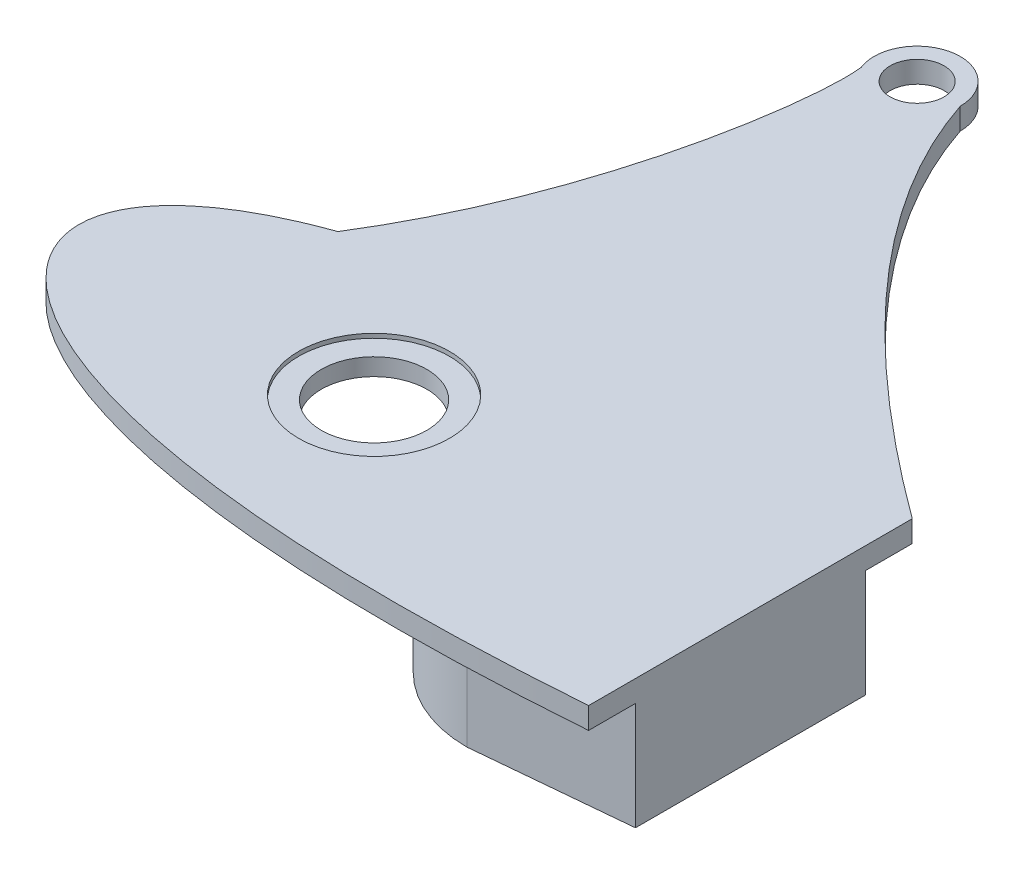
ISO-10303-21;
HEADER;
FILE_DESCRIPTION(('STEP AP214'),'2;1');
FILE_NAME('part.step','',(''),(''),'','','');
FILE_SCHEMA(('AUTOMOTIVE_DESIGN { 1 0 10303 214 1 1 1 1 }'));
ENDSEC;
DATA;
#1=APPLICATION_CONTEXT('core data for automotive mechanical design processes');
#2=APPLICATION_PROTOCOL_DEFINITION('international standard','automotive_design',2000,#1);
#3=PRODUCT_CONTEXT('',#1,'mechanical');
#4=PRODUCT('Part','Part','',(#3));
#5=PRODUCT_RELATED_PRODUCT_CATEGORY('part','',(#4));
#6=PRODUCT_DEFINITION_FORMATION('','',#4);
#7=PRODUCT_DEFINITION_CONTEXT('part definition',#1,'design');
#8=PRODUCT_DEFINITION('design','',#6,#7);
#9=PRODUCT_DEFINITION_SHAPE('','',#8);
#10=(LENGTH_UNIT() NAMED_UNIT(*) SI_UNIT(.MILLI.,.METRE.));
#11=(NAMED_UNIT(*) PLANE_ANGLE_UNIT() SI_UNIT($,.RADIAN.));
#12=(NAMED_UNIT(*) SI_UNIT($,.STERADIAN.) SOLID_ANGLE_UNIT());
#13=UNCERTAINTY_MEASURE_WITH_UNIT(LENGTH_MEASURE(1.E-05),#10,'distance_accuracy_value','');
#14=(GEOMETRIC_REPRESENTATION_CONTEXT(3) GLOBAL_UNCERTAINTY_ASSIGNED_CONTEXT((#13)) GLOBAL_UNIT_ASSIGNED_CONTEXT((#10,
#11,#12)) REPRESENTATION_CONTEXT('',''));
#15=CARTESIAN_POINT('',(0.,0.,0.));
#16=DIRECTION('',(0.,0.,1.));
#17=DIRECTION('',(1.,0.,0.));
#18=AXIS2_PLACEMENT_3D('',#15,#16,#17);
#19=CARTESIAN_POINT('',(-71.828032240755,2.54000000000021,5.55111512312578E-13));
#20=DIRECTION('',(0.,-1.,0.));
#21=DIRECTION('',(0.,0.,-0.999999999999999));
#22=AXIS2_PLACEMENT_3D('',#19,#20,#21);
#23=CYLINDRICAL_SURFACE('',#22,6.22299999999501);
#24=CARTESIAN_POINT('',(-71.828032240755,0.,5.55111512312578E-13));
#25=DIRECTION('',(0.,1.,0.));
#26=DIRECTION('',(0.,0.,0.999999999999999));
#27=AXIS2_PLACEMENT_3D('',#24,#25,#26);
#28=CIRCLE('',#27,6.22299999999501);
#29=CARTESIAN_POINT('',(-71.828032240755,0.,6.22299999999556));
#30=VERTEX_POINT('',#29);
#31=EDGE_CURVE('E291',#30,#30,#28,.T.);
#32=ORIENTED_EDGE('',*,*,#31,.F.);
#33=EDGE_LOOP('',(#32));
#34=FACE_BOUND('',#33,.T.);
#35=CARTESIAN_POINT('',(-71.828032240755,2.03199999999981,5.55111512312578E-13));
#36=DIRECTION('',(0.,1.,0.));
#37=DIRECTION('',(0.,0.,0.999999999999999));
#38=AXIS2_PLACEMENT_3D('',#35,#36,#37);
#39=CIRCLE('',#38,6.22299999999501);
#40=CARTESIAN_POINT('',(-71.828032240755,2.03199999999981,6.22299999999556));
#41=VERTEX_POINT('',#40);
#42=EDGE_CURVE('E139',#41,#41,#39,.T.);
#43=ORIENTED_EDGE('',*,*,#42,.T.);
#44=EDGE_LOOP('',(#43));
#45=FACE_BOUND('',#44,.T.);
#46=ADVANCED_FACE('F134',(#34,#45),#23,.F.);
#47=CARTESIAN_POINT('',(-100.787840288898,0.,-9.37989943616269));
#48=DIRECTION('',(0.,1.,0.));
#49=DIRECTION('',(0.,0.,0.999999999999999));
#50=AXIS2_PLACEMENT_3D('',#47,#48,#49);
#51=PLANE('',#50);
#52=CARTESIAN_POINT('',(-93.0623069318068,0.,-1.49880108324396E-11));
#53=DIRECTION('',(0.,1.,0.));
#54=DIRECTION('',(0.,0.,0.999999999999999));
#55=AXIS2_PLACEMENT_3D('',#52,#53,#54);
#56=CIRCLE('',#55,4.23333333282159);
#57=CARTESIAN_POINT('',(-93.0623069318068,0.,4.2333333328066));
#58=VERTEX_POINT('',#57);
#59=EDGE_CURVE('E333',#58,#58,#56,.T.);
#60=ORIENTED_EDGE('',*,*,#59,.T.);
#61=EDGE_LOOP('',(#60));
#62=FACE_BOUND('',#61,.T.);
#63=ORIENTED_EDGE('',*,*,#31,.T.);
#64=EDGE_LOOP('',(#63));
#65=FACE_BOUND('',#64,.T.);
#66=CARTESIAN_POINT('',(-71.8280322407545,0.,-63.9942784536835));
#67=DIRECTION('',(0.,-1.,0.));
#68=DIRECTION('',(0.,0.,-0.999999999999999));
#69=AXIS2_PLACEMENT_3D('',#66,#67,#68);
#70=CIRCLE('',#69,3.17499999999613);
#71=CARTESIAN_POINT('',(-71.8280322407545,0.,-67.1692784536797));
#72=VERTEX_POINT('',#71);
#73=EDGE_CURVE('E300',#72,#72,#70,.T.);
#74=ORIENTED_EDGE('',*,*,#73,.F.);
#75=EDGE_LOOP('',(#74));
#76=FACE_BOUND('',#75,.T.);
#77=DIRECTION('',(0.995681906627091,0.,0.0928307105188746));
#78=VECTOR('',#77,1.);
#79=CARTESIAN_POINT('',(1.01510215205147,0.,-10.887763764025));
#80=LINE('',#79,#78);
#81=CARTESIAN_POINT('',(-45.6660322407338,0.,-15.2399999999815));
#82=VERTEX_POINT('',#81);
#83=CARTESIAN_POINT('',(-27.4797575526233,0.,-13.5444335848929));
#84=VERTEX_POINT('',#83);
#85=EDGE_CURVE('E329',#82,#84,#80,.T.);
#86=ORIENTED_EDGE('',*,*,#85,.F.);
#87=CARTESIAN_POINT('',(-45.6660322407547,0.,1.7874590696465E-11));
#88=DIRECTION('',(0.,1.,0.));
#89=DIRECTION('',(0.,0.,0.999999999999999));
#90=AXIS2_PLACEMENT_3D('',#87,#88,#89);
#91=CIRCLE('',#90,15.24);
#92=CARTESIAN_POINT('',(-45.6660322407547,0.,15.2400000000178));
#93=VERTEX_POINT('',#92);
#94=EDGE_CURVE('E325',#82,#93,#91,.T.);
#95=ORIENTED_EDGE('',*,*,#94,.T.);
#96=DIRECTION('',(0.995681906627528,0.,-0.0928307105141882));
#97=VECTOR('',#96,1.);
#98=CARTESIAN_POINT('',(1.01510215202327,0.,10.8877637642829));
#99=LINE('',#98,#97);
#100=CARTESIAN_POINT('',(-27.4797575526233,0.,13.5444335850131));
#101=VERTEX_POINT('',#100);
#102=EDGE_CURVE('E321',#93,#101,#99,.T.);
#103=ORIENTED_EDGE('',*,*,#102,.T.);
#104=DIRECTION('',(0.,0.,0.999999999999999));
#105=VECTOR('',#104,1.);
#106=CARTESIAN_POINT('',(-27.4797575526231,0.,-19.0692045360898));
#107=LINE('',#106,#105);
#108=CARTESIAN_POINT('',(-27.4797575526233,0.,19.0692045361251));
#109=VERTEX_POINT('',#108);
#110=EDGE_CURVE('E427',#101,#109,#107,.T.);
#111=ORIENTED_EDGE('',*,*,#110,.T.);
#112=CARTESIAN_POINT('',(-106.608177042693,0.,-2.40918396343659E-11));
#113=CARTESIAN_POINT('',(-106.607181852749,0.,0.336221439301454));
#114=CARTESIAN_POINT('',(-106.553109217043,0.,1.1724708441877));
#115=CARTESIAN_POINT('',(-106.231145111325,0.,2.64309926122397));
#116=CARTESIAN_POINT('',(-105.43920338288,0.,4.47521740094181));
#117=CARTESIAN_POINT('',(-104.022724766245,0.,6.50434841127334));
#118=CARTESIAN_POINT('',(-101.933239025809,0.,8.57165132499871));
#119=CARTESIAN_POINT('',(-99.1919114881492,0.,10.567556696316));
#120=CARTESIAN_POINT('',(-95.8449968360548,0.,12.426747292297));
#121=CARTESIAN_POINT('',(-91.9425260766369,0.,14.1114417039812));
#122=CARTESIAN_POINT('',(-87.5318954831836,0.,15.5993181547301));
#123=CARTESIAN_POINT('',(-82.6571006592551,0.,16.8771333157254));
#124=CARTESIAN_POINT('',(-77.3593433017097,0.,17.9374356125432));
#125=CARTESIAN_POINT('',(-71.6778007456686,0.,18.7767405652854));
#126=CARTESIAN_POINT('',(-65.6503412533955,0.,19.3954605787643));
#127=CARTESIAN_POINT('',(-59.3137850653509,0.,19.7965740230732));
#128=CARTESIAN_POINT('',(-52.7042467276422,0.,19.9862763091176));
#129=CARTESIAN_POINT('',(-45.8571956117444,0.,19.9728658304196));
#130=CARTESIAN_POINT('',(-38.8075573417097,0.,19.7673224628712));
#131=CARTESIAN_POINT('',(-32.659211886195,0.,19.4395653250897));
#132=CARTESIAN_POINT('',(-28.8658001620383,0.,19.174037810697));
#133=CARTESIAN_POINT('',(-27.4797575526233,0.,19.0692045361251));
#134=B_SPLINE_CURVE_WITH_KNOTS('',3,(#112,#113,#114,#115,#116,#117,#118,#119,#120,#121,#122,
#123,#124,#125,#126,#127,#128,#129,#130,#131,#132,#133),.UNSPECIFIED.,.F.,.F.,(4,1,1,1,1,1,1,1,
1,1,1,1,1,1,1,1,1,1,1,4),(0.5,0.502166768562745,0.505390167385713,0.509655974305835,
0.514947681887198,0.521244711429097,0.528520886222697,0.536744945012688,0.545881360311019,
0.555890751085959,0.566730118512969,0.578352990409744,0.59070958813284,0.603747039427916,
0.617409572172202,0.631638768029288,0.646373793426418,0.66155165817642,0.677107482822761,
0.6860697244594),.UNSPECIFIED.);
#135=CARTESIAN_POINT('',(-106.608177042693,0.,-2.40918396343659E-11));
#136=VERTEX_POINT('',#135);
#137=EDGE_CURVE('E290',#136,#109,#134,.T.);
#138=ORIENTED_EDGE('',*,*,#137,.F.);
#139=CARTESIAN_POINT('',(-106.608177042693,0.,-2.40918396343659E-11));
#140=CARTESIAN_POINT('',(-106.607181852748,0.,-0.336221439350415));
#141=CARTESIAN_POINT('',(-106.553109217039,0.,-1.17247084423733));
#142=CARTESIAN_POINT('',(-106.231145111316,0.,-2.64309926127493));
#143=CARTESIAN_POINT('',(-105.439203382865,0.,-4.4752174009941));
#144=CARTESIAN_POINT('',(-104.022724766221,0.,-6.50434841132486));
#145=CARTESIAN_POINT('',(-101.933239025776,0.,-8.57165132504756));
#146=CARTESIAN_POINT('',(-99.1919114881057,0.,-10.5675566963589));
#147=CARTESIAN_POINT('',(-95.8449968360004,0.,-12.4267472923335));
#148=CARTESIAN_POINT('',(-92.9040958197425,0.,-13.6963325917004));
#149=CARTESIAN_POINT('',(-91.0995653454139,0.,-14.3638445961974));
#150=CARTESIAN_POINT('',(-90.6222284065501,0.,-14.5334115477175));
#151=B_SPLINE_CURVE_WITH_KNOTS('',3,(#139,#140,#141,#142,#143,#144,#145,#146,#147,#148,#149,
#150),.UNSPECIFIED.,.F.,.F.,(4,1,1,1,1,1,1,1,1,4),(0.5,0.502166768562745,0.505390167385713,
0.509655974305835,0.514947681887198,0.521244711429097,0.528520886222697,0.536744945012688,
0.545881360311019,0.549146809734544),.UNSPECIFIED.);
#152=CARTESIAN_POINT('',(-90.6222284065501,0.,-14.5334115477175));
#153=VERTEX_POINT('',#152);
#154=EDGE_CURVE('E298',#136,#153,#151,.T.);
#155=ORIENTED_EDGE('',*,*,#154,.T.);
#156=CARTESIAN_POINT('',(-90.6222284065501,0.,-14.5334115477175));
#157=CARTESIAN_POINT('',(-78.6766231938323,0.,-33.6240352561603));
#158=CARTESIAN_POINT('',(-75.8140328910315,0.,-56.6964019830253));
#159=CARTESIAN_POINT('',(-76.5562174906114,0.,-62.136682091974));
#160=B_SPLINE_CURVE_WITH_KNOTS('',3,(#156,#157,#158,#159),.UNSPECIFIED.,.F.,.F.,(4,4),(0.,1.),.UNSPECIFIED.);
#161=CARTESIAN_POINT('',(-76.5562174906114,0.,-62.136682091974));
#162=VERTEX_POINT('',#161);
#163=EDGE_CURVE('E407',#153,#162,#160,.T.);
#164=ORIENTED_EDGE('',*,*,#163,.T.);
#165=CARTESIAN_POINT('',(-71.8280322407545,0.,-63.9942784536835));
#166=DIRECTION('',(0.,-1.,0.));
#167=DIRECTION('',(0.,0.,-0.999999999999999));
#168=AXIS2_PLACEMENT_3D('',#165,#166,#167);
#169=CIRCLE('',#168,5.08);
#170=CARTESIAN_POINT('',(-66.748032240755,0.,-63.9942784536837));
#171=VERTEX_POINT('',#170);
#172=EDGE_CURVE('E416',#162,#171,#169,.T.);
#173=ORIENTED_EDGE('',*,*,#172,.T.);
#174=CARTESIAN_POINT('',(-66.748032240755,0.,-63.9942784536837));
#175=CARTESIAN_POINT('',(-59.6627837087809,0.,-42.6772678713619));
#176=CARTESIAN_POINT('',(-27.4797575526231,0.,-19.0692045360898));
#177=B_SPLINE_CURVE_WITH_KNOTS('',2,(#174,#175,#176),.UNSPECIFIED.,.F.,.F.,(3,3),(0.,1.),.UNSPECIFIED.);
#178=CARTESIAN_POINT('',(-27.4797575526231,0.,-19.0692045360898));
#179=VERTEX_POINT('',#178);
#180=EDGE_CURVE('E423',#171,#179,#177,.T.);
#181=ORIENTED_EDGE('',*,*,#180,.T.);
#182=EDGE_CURVE('E230',#179,#84,#107,.T.);
#183=ORIENTED_EDGE('',*,*,#182,.T.);
#184=EDGE_LOOP('',(#86,#95,#103,#111,#138,#155,#164,#173,#181,#183));
#185=FACE_BOUND('',#184,.T.);
#186=ADVANCED_FACE('F378',(#62,#65,#76,#185),#51,.F.);
#187=CARTESIAN_POINT('',(-100.787840288898,2.54000000000021,-9.37989943616269));
#188=DIRECTION('',(0.,1.,0.));
#189=DIRECTION('',(0.,0.,0.999999999999999));
#190=AXIS2_PLACEMENT_3D('',#187,#188,#189);
#191=PLANE('',#190);
#192=CARTESIAN_POINT('',(-71.828032240755,2.54000000000021,5.55111512312578E-13));
#193=DIRECTION('',(0.,1.,0.));
#194=DIRECTION('',(0.,0.,0.999999999999999));
#195=AXIS2_PLACEMENT_3D('',#192,#193,#194);
#196=CIRCLE('',#195,8.88999999999499);
#197=CARTESIAN_POINT('',(-71.828032240755,2.54000000000021,8.88999999999554));
#198=VERTEX_POINT('',#197);
#199=EDGE_CURVE('E353',#198,#198,#196,.T.);
#200=ORIENTED_EDGE('',*,*,#199,.F.);
#201=EDGE_LOOP('',(#200));
#202=FACE_BOUND('',#201,.T.);
#203=CARTESIAN_POINT('',(-71.8280322407545,2.54000000000021,-63.9942784536835));
#204=DIRECTION('',(0.,-1.,0.));
#205=DIRECTION('',(0.,0.,-0.999999999999999));
#206=AXIS2_PLACEMENT_3D('',#203,#204,#205);
#207=CIRCLE('',#206,3.17499999999613);
#208=CARTESIAN_POINT('',(-71.8280322407545,2.54000000000021,-67.1692784536797));
#209=VERTEX_POINT('',#208);
#210=EDGE_CURVE('E299',#209,#209,#207,.T.);
#211=ORIENTED_EDGE('',*,*,#210,.T.);
#212=EDGE_LOOP('',(#211));
#213=FACE_BOUND('',#212,.T.);
#214=CARTESIAN_POINT('',(-106.608177042693,2.54000000000021,-2.40918396343659E-11));
#215=CARTESIAN_POINT('',(-106.607181852748,2.54000000000021,-0.336221439350415));
#216=CARTESIAN_POINT('',(-106.553109217039,2.54000000000021,-1.17247084423733));
#217=CARTESIAN_POINT('',(-106.231145111316,2.54000000000021,-2.64309926127493));
#218=CARTESIAN_POINT('',(-105.439203382865,2.54000000000021,-4.4752174009941));
#219=CARTESIAN_POINT('',(-104.022724766221,2.54000000000021,-6.50434841132486));
#220=CARTESIAN_POINT('',(-101.933239025776,2.54000000000021,-8.57165132504756));
#221=CARTESIAN_POINT('',(-99.1919114881057,2.54000000000021,-10.5675566963589));
#222=CARTESIAN_POINT('',(-95.8449968360004,2.54000000000021,-12.4267472923335));
#223=CARTESIAN_POINT('',(-92.9040958197425,2.54000000000021,-13.6963325917004));
#224=CARTESIAN_POINT('',(-91.0995653454139,2.54000000000021,-14.3638445961974));
#225=CARTESIAN_POINT('',(-90.6222284065501,2.54000000000021,-14.5334115477175));
#226=B_SPLINE_CURVE_WITH_KNOTS('',3,(#214,#215,#216,#217,#218,#219,#220,#221,#222,#223,#224,
#225),.UNSPECIFIED.,.F.,.F.,(4,1,1,1,1,1,1,1,1,4),(0.5,0.502166768562745,0.505390167385713,
0.509655974305835,0.514947681887198,0.521244711429097,0.528520886222697,0.536744945012688,
0.545881360311019,0.549146809734544),.UNSPECIFIED.);
#227=CARTESIAN_POINT('',(-106.608177042693,2.54000000000021,-2.40918396343659E-11));
#228=VERTEX_POINT('',#227);
#229=CARTESIAN_POINT('',(-90.6222284065501,2.54000000000021,-14.5334115477175));
#230=VERTEX_POINT('',#229);
#231=EDGE_CURVE('E281',#228,#230,#226,.T.);
#232=ORIENTED_EDGE('',*,*,#231,.F.);
#233=CARTESIAN_POINT('',(-106.608177042693,2.54000000000021,-2.40918396343659E-11));
#234=CARTESIAN_POINT('',(-106.607181852749,2.54000000000021,0.336221439301454));
#235=CARTESIAN_POINT('',(-106.553109217043,2.54000000000021,1.1724708441877));
#236=CARTESIAN_POINT('',(-106.231145111325,2.54000000000021,2.64309926122397));
#237=CARTESIAN_POINT('',(-105.43920338288,2.54000000000021,4.47521740094181));
#238=CARTESIAN_POINT('',(-104.022724766245,2.54000000000021,6.50434841127334));
#239=CARTESIAN_POINT('',(-101.933239025809,2.54000000000021,8.57165132499871));
#240=CARTESIAN_POINT('',(-99.1919114881492,2.54000000000021,10.567556696316));
#241=CARTESIAN_POINT('',(-95.8449968360548,2.54000000000021,12.426747292297));
#242=CARTESIAN_POINT('',(-91.9425260766369,2.54000000000021,14.1114417039812));
#243=CARTESIAN_POINT('',(-87.5318954831836,2.54000000000021,15.5993181547301));
#244=CARTESIAN_POINT('',(-82.6571006592551,2.54000000000021,16.8771333157254));
#245=CARTESIAN_POINT('',(-77.3593433017097,2.54000000000021,17.9374356125432));
#246=CARTESIAN_POINT('',(-71.6778007456686,2.54000000000021,18.7767405652854));
#247=CARTESIAN_POINT('',(-65.6503412533955,2.54000000000021,19.3954605787643));
#248=CARTESIAN_POINT('',(-59.3137850653509,2.54000000000021,19.7965740230732));
#249=CARTESIAN_POINT('',(-52.7042467276422,2.54000000000021,19.9862763091176));
#250=CARTESIAN_POINT('',(-45.8571956117444,2.54000000000021,19.9728658304196));
#251=CARTESIAN_POINT('',(-38.8075573417097,2.54000000000021,19.7673224628712));
#252=CARTESIAN_POINT('',(-32.659211886195,2.54000000000021,19.4395653250897));
#253=CARTESIAN_POINT('',(-28.8658001620383,2.54000000000021,19.174037810697));
#254=CARTESIAN_POINT('',(-27.4797575526233,2.54000000000021,19.0692045361251));
#255=B_SPLINE_CURVE_WITH_KNOTS('',3,(#233,#234,#235,#236,#237,#238,#239,#240,#241,#242,#243,
#244,#245,#246,#247,#248,#249,#250,#251,#252,#253,#254),.UNSPECIFIED.,.F.,.F.,(4,1,1,1,1,1,1,1,
1,1,1,1,1,1,1,1,1,1,1,4),(0.5,0.502166768562745,0.505390167385713,0.509655974305835,
0.514947681887198,0.521244711429097,0.528520886222697,0.536744945012688,0.545881360311019,
0.555890751085959,0.566730118512969,0.578352990409744,0.59070958813284,0.603747039427916,
0.617409572172202,0.631638768029288,0.646373793426418,0.66155165817642,0.677107482822761,
0.6860697244594),.UNSPECIFIED.);
#256=CARTESIAN_POINT('',(-27.4797575526233,2.54000000000021,19.0692045361251));
#257=VERTEX_POINT('',#256);
#258=EDGE_CURVE('E245',#228,#257,#255,.T.);
#259=ORIENTED_EDGE('',*,*,#258,.T.);
#260=DIRECTION('',(0.,0.,0.999999999999999));
#261=VECTOR('',#260,1.);
#262=CARTESIAN_POINT('',(-27.4797575526231,2.54000000000021,-19.0692045360898));
#263=LINE('',#262,#261);
#264=CARTESIAN_POINT('',(-27.4797575526231,2.54000000000021,-19.0692045360898));
#265=VERTEX_POINT('',#264);
#266=EDGE_CURVE('E227',#265,#257,#263,.T.);
#267=ORIENTED_EDGE('',*,*,#266,.F.);
#268=CARTESIAN_POINT('',(-66.748032240755,2.54000000000021,-63.9942784536837));
#269=CARTESIAN_POINT('',(-59.6627837087809,2.54000000000021,-42.6772678713619));
#270=CARTESIAN_POINT('',(-27.4797575526231,2.54000000000021,-19.0692045360898));
#271=B_SPLINE_CURVE_WITH_KNOTS('',2,(#268,#269,#270),.UNSPECIFIED.,.F.,.F.,(3,3),(0.,1.),.UNSPECIFIED.);
#272=CARTESIAN_POINT('',(-66.748032240755,2.54000000000021,-63.9942784536837));
#273=VERTEX_POINT('',#272);
#274=EDGE_CURVE('E243',#273,#265,#271,.T.);
#275=ORIENTED_EDGE('',*,*,#274,.F.);
#276=CARTESIAN_POINT('',(-71.8280322407545,2.54000000000021,-63.9942784536835));
#277=DIRECTION('',(0.,-1.,0.));
#278=DIRECTION('',(0.,0.,-0.999999999999999));
#279=AXIS2_PLACEMENT_3D('',#276,#277,#278);
#280=CIRCLE('',#279,5.08);
#281=CARTESIAN_POINT('',(-76.5562174906114,2.54000000000021,-62.136682091974));
#282=VERTEX_POINT('',#281);
#283=EDGE_CURVE('E251',#282,#273,#280,.T.);
#284=ORIENTED_EDGE('',*,*,#283,.F.);
#285=CARTESIAN_POINT('',(-90.6222284065501,2.54000000000021,-14.5334115477175));
#286=CARTESIAN_POINT('',(-78.6766231938323,2.54000000000021,-33.6240352561603));
#287=CARTESIAN_POINT('',(-75.8140328910315,2.54000000000021,-56.6964019830253));
#288=CARTESIAN_POINT('',(-76.5562174906114,2.54000000000021,-62.136682091974));
#289=B_SPLINE_CURVE_WITH_KNOTS('',3,(#285,#286,#287,#288),.UNSPECIFIED.,.F.,.F.,(4,4),(0.,1.),.UNSPECIFIED.);
#290=EDGE_CURVE('E256',#230,#282,#289,.T.);
#291=ORIENTED_EDGE('',*,*,#290,.F.);
#292=EDGE_LOOP('',(#232,#259,#267,#275,#284,#291));
#293=FACE_BOUND('',#292,.T.);
#294=ADVANCED_FACE('F241',(#202,#213,#293),#191,.T.);
#295=DIRECTION('',(0.,-1.,0.));
#296=VECTOR('',#295,1.);
#297=SURFACE_OF_LINEAR_EXTRUSION('',#226,#296);
#298=ORIENTED_EDGE('',*,*,#154,.F.);
#299=DIRECTION('',(0.,-1.,0.));
#300=VECTOR('',#299,1.);
#301=CARTESIAN_POINT('',(-106.608177042693,2.54000000000021,-2.40918396343659E-11));
#302=LINE('',#301,#300);
#303=EDGE_CURVE('E12',#228,#136,#302,.T.);
#304=ORIENTED_EDGE('',*,*,#303,.F.);
#305=ORIENTED_EDGE('',*,*,#231,.T.);
#306=DIRECTION('',(0.,-1.,0.));
#307=VECTOR('',#306,1.);
#308=CARTESIAN_POINT('',(-90.6222284065501,2.54000000000021,-14.5334115477175));
#309=LINE('',#308,#307);
#310=EDGE_CURVE('E205',#230,#153,#309,.T.);
#311=ORIENTED_EDGE('',*,*,#310,.T.);
#312=EDGE_LOOP('',(#298,#304,#305,#311));
#313=FACE_BOUND('',#312,.T.);
#314=ADVANCED_FACE('F136',(#313),#297,.T.);
#315=DIRECTION('',(0.,-1.,0.));
#316=VECTOR('',#315,1.);
#317=SURFACE_OF_LINEAR_EXTRUSION('',#255,#316);
#318=ORIENTED_EDGE('',*,*,#137,.T.);
#319=DIRECTION('',(0.,-1.,0.));
#320=VECTOR('',#319,1.);
#321=CARTESIAN_POINT('',(-27.4797575526233,2.54000000000021,19.0692045361251));
#322=LINE('',#321,#320);
#323=EDGE_CURVE('E145',#257,#109,#322,.T.);
#324=ORIENTED_EDGE('',*,*,#323,.F.);
#325=ORIENTED_EDGE('',*,*,#258,.F.);
#326=ORIENTED_EDGE('',*,*,#303,.T.);
#327=EDGE_LOOP('',(#318,#324,#325,#326));
#328=FACE_BOUND('',#327,.T.);
#329=ADVANCED_FACE('F392',(#328),#317,.F.);
#330=CARTESIAN_POINT('',(-27.4797575526231,2.54000000000021,-19.0692045360898));
#331=DIRECTION('',(0.999999999999999,0.,0.));
#332=DIRECTION('',(0.,0.,-0.999999999999999));
#333=AXIS2_PLACEMENT_3D('',#330,#331,#332);
#334=PLANE('',#333);
#335=ORIENTED_EDGE('',*,*,#182,.F.);
#336=DIRECTION('',(0.,-1.,0.));
#337=VECTOR('',#336,1.);
#338=CARTESIAN_POINT('',(-27.4797575526231,2.54000000000021,-19.0692045360898));
#339=LINE('',#338,#337);
#340=EDGE_CURVE('E223',#265,#179,#339,.T.);
#341=ORIENTED_EDGE('',*,*,#340,.F.);
#342=ORIENTED_EDGE('',*,*,#266,.T.);
#343=ORIENTED_EDGE('',*,*,#323,.T.);
#344=ORIENTED_EDGE('',*,*,#110,.F.);
#345=DIRECTION('',(0.,1.,0.));
#346=VECTOR('',#345,1.);
#347=CARTESIAN_POINT('',(-27.4797575526233,-12.7000000000002,13.5444335850131));
#348=LINE('',#347,#346);
#349=CARTESIAN_POINT('',(-27.4797575526233,-12.7000000000002,13.5444335850131));
#350=VERTEX_POINT('',#349);
#351=EDGE_CURVE('E156',#350,#101,#348,.T.);
#352=ORIENTED_EDGE('',*,*,#351,.F.);
#353=DIRECTION('',(0.,0.,0.999999999999999));
#354=VECTOR('',#353,1.);
#355=CARTESIAN_POINT('',(-27.4797575526229,-12.7000000000002,8.88178419700125E-13));
#356=LINE('',#355,#354);
#357=CARTESIAN_POINT('',(-27.4797575526233,-12.7000000000002,-13.5444335848929));
#358=VERTEX_POINT('',#357);
#359=EDGE_CURVE('E313',#358,#350,#356,.T.);
#360=ORIENTED_EDGE('',*,*,#359,.F.);
#361=DIRECTION('',(0.,1.,0.));
#362=VECTOR('',#361,1.);
#363=CARTESIAN_POINT('',(-27.4797575526233,-12.7000000000002,-13.5444335848929));
#364=LINE('',#363,#362);
#365=EDGE_CURVE('E304',#358,#84,#364,.T.);
#366=ORIENTED_EDGE('',*,*,#365,.T.);
#367=EDGE_LOOP('',(#335,#341,#342,#343,#344,#352,#360,#366));
#368=FACE_BOUND('',#367,.T.);
#369=ADVANCED_FACE('F225',(#368),#334,.T.);
#370=DIRECTION('',(0.,-1.,0.));
#371=VECTOR('',#370,1.);
#372=SURFACE_OF_LINEAR_EXTRUSION('',#271,#371);
#373=ORIENTED_EDGE('',*,*,#180,.F.);
#374=DIRECTION('',(0.,-1.,0.));
#375=VECTOR('',#374,1.);
#376=CARTESIAN_POINT('',(-66.748032240755,2.54000000000021,-63.9942784536837));
#377=LINE('',#376,#375);
#378=EDGE_CURVE('E236',#273,#171,#377,.T.);
#379=ORIENTED_EDGE('',*,*,#378,.F.);
#380=ORIENTED_EDGE('',*,*,#274,.T.);
#381=ORIENTED_EDGE('',*,*,#340,.T.);
#382=EDGE_LOOP('',(#373,#379,#380,#381));
#383=FACE_BOUND('',#382,.T.);
#384=ADVANCED_FACE('F249',(#383),#372,.T.);
#385=CARTESIAN_POINT('',(-71.8280322407545,2.54000000000021,-63.9942784536835));
#386=DIRECTION('',(0.,-1.,0.));
#387=DIRECTION('',(0.,0.,-0.999999999999999));
#388=AXIS2_PLACEMENT_3D('',#385,#386,#387);
#389=CYLINDRICAL_SURFACE('',#388,5.08);
#390=ORIENTED_EDGE('',*,*,#172,.F.);
#391=DIRECTION('',(0.,-1.,0.));
#392=VECTOR('',#391,1.);
#393=CARTESIAN_POINT('',(-76.5562174906114,2.54000000000021,-62.136682091974));
#394=LINE('',#393,#392);
#395=EDGE_CURVE('E444',#282,#162,#394,.T.);
#396=ORIENTED_EDGE('',*,*,#395,.F.);
#397=ORIENTED_EDGE('',*,*,#283,.T.);
#398=ORIENTED_EDGE('',*,*,#378,.T.);
#399=EDGE_LOOP('',(#390,#396,#397,#398));
#400=FACE_BOUND('',#399,.T.);
#401=ADVANCED_FACE('F270',(#400),#389,.T.);
#402=DIRECTION('',(0.,-1.,0.));
#403=VECTOR('',#402,1.);
#404=SURFACE_OF_LINEAR_EXTRUSION('',#289,#403);
#405=ORIENTED_EDGE('',*,*,#163,.F.);
#406=ORIENTED_EDGE('',*,*,#310,.F.);
#407=ORIENTED_EDGE('',*,*,#290,.T.);
#408=ORIENTED_EDGE('',*,*,#395,.T.);
#409=EDGE_LOOP('',(#405,#406,#407,#408));
#410=FACE_BOUND('',#409,.T.);
#411=ADVANCED_FACE('F273',(#410),#404,.T.);
#412=CARTESIAN_POINT('',(-71.8280322407545,2.54000000000021,-63.9942784536835));
#413=DIRECTION('',(0.,-1.,0.));
#414=DIRECTION('',(0.,0.,-0.999999999999999));
#415=AXIS2_PLACEMENT_3D('',#412,#413,#414);
#416=CYLINDRICAL_SURFACE('',#415,3.17499999999613);
#417=ORIENTED_EDGE('',*,*,#210,.F.);
#418=EDGE_LOOP('',(#417));
#419=FACE_BOUND('',#418,.T.);
#420=ORIENTED_EDGE('',*,*,#73,.T.);
#421=EDGE_LOOP('',(#420));
#422=FACE_BOUND('',#421,.T.);
#423=ADVANCED_FACE('F276',(#419,#422),#416,.F.);
#424=CARTESIAN_POINT('',(1.01510215205147,-12.7000000000002,-10.887763764025));
#425=DIRECTION('',(-0.0928307105188746,0.,0.995681906627091));
#426=DIRECTION('',(0.995681906627092,0.,0.0928307105188746));
#427=AXIS2_PLACEMENT_3D('',#424,#425,#426);
#428=PLANE('',#427);
#429=ORIENTED_EDGE('',*,*,#85,.T.);
#430=ORIENTED_EDGE('',*,*,#365,.F.);
#431=DIRECTION('',(0.995681906627091,0.,0.0928307105188746));
#432=VECTOR('',#431,1.);
#433=CARTESIAN_POINT('',(1.01510215205147,-12.7000000000002,-10.887763764025));
#434=LINE('',#433,#432);
#435=CARTESIAN_POINT('',(-45.6660322407338,-12.7000000000002,-15.2399999999815));
#436=VERTEX_POINT('',#435);
#437=EDGE_CURVE('E324',#436,#358,#434,.T.);
#438=ORIENTED_EDGE('',*,*,#437,.F.);
#439=DIRECTION('',(0.,1.,0.));
#440=VECTOR('',#439,1.);
#441=CARTESIAN_POINT('',(-45.6660322407338,-12.7000000000002,-15.2399999999815));
#442=LINE('',#441,#440);
#443=EDGE_CURVE('E308',#436,#82,#442,.T.);
#444=ORIENTED_EDGE('',*,*,#443,.T.);
#445=EDGE_LOOP('',(#429,#430,#438,#444));
#446=FACE_BOUND('',#445,.T.);
#447=ADVANCED_FACE('F475',(#446),#428,.F.);
#448=CARTESIAN_POINT('',(1.01510215202327,-12.7000000000002,10.8877637642829));
#449=DIRECTION('',(0.0928307105141883,0.,0.995681906627528));
#450=DIRECTION('',(0.995681906627528,0.,-0.0928307105141882));
#451=AXIS2_PLACEMENT_3D('',#448,#449,#450);
#452=PLANE('',#451);
#453=ORIENTED_EDGE('',*,*,#102,.F.);
#454=DIRECTION('',(0.,1.,0.));
#455=VECTOR('',#454,1.);
#456=CARTESIAN_POINT('',(-45.6660322407547,-12.7000000000002,15.2400000000178));
#457=LINE('',#456,#455);
#458=CARTESIAN_POINT('',(-45.6660322407547,-12.7000000000002,15.2400000000178));
#459=VERTEX_POINT('',#458);
#460=EDGE_CURVE('E312',#459,#93,#457,.T.);
#461=ORIENTED_EDGE('',*,*,#460,.F.);
#462=DIRECTION('',(0.995681906627528,0.,-0.0928307105141882));
#463=VECTOR('',#462,1.);
#464=CARTESIAN_POINT('',(1.01510215202327,-12.7000000000002,10.8877637642829));
#465=LINE('',#464,#463);
#466=EDGE_CURVE('E337',#459,#350,#465,.T.);
#467=ORIENTED_EDGE('',*,*,#466,.T.);
#468=ORIENTED_EDGE('',*,*,#351,.T.);
#469=EDGE_LOOP('',(#453,#461,#467,#468));
#470=FACE_BOUND('',#469,.T.);
#471=ADVANCED_FACE('F458',(#470),#452,.T.);
#472=CARTESIAN_POINT('',(-45.6660322407547,-12.7000000000002,1.7874590696465E-11));
#473=DIRECTION('',(0.,1.,0.));
#474=DIRECTION('',(0.,0.,0.999999999999999));
#475=AXIS2_PLACEMENT_3D('',#472,#473,#474);
#476=CYLINDRICAL_SURFACE('',#475,15.24);
#477=ORIENTED_EDGE('',*,*,#94,.F.);
#478=ORIENTED_EDGE('',*,*,#443,.F.);
#479=CARTESIAN_POINT('',(-45.6660322407547,-12.7000000000002,1.7874590696465E-11));
#480=DIRECTION('',(0.,1.,0.));
#481=DIRECTION('',(0.,0.,0.999999999999999));
#482=AXIS2_PLACEMENT_3D('',#479,#480,#481);
#483=CIRCLE('',#482,15.24);
#484=EDGE_CURVE('E340',#436,#459,#483,.T.);
#485=ORIENTED_EDGE('',*,*,#484,.T.);
#486=ORIENTED_EDGE('',*,*,#460,.T.);
#487=EDGE_LOOP('',(#477,#478,#485,#486));
#488=FACE_BOUND('',#487,.T.);
#489=ADVANCED_FACE('F467',(#488),#476,.T.);
#490=CARTESIAN_POINT('',(0.,-12.7000000000002,0.));
#491=DIRECTION('',(0.,1.,0.));
#492=DIRECTION('',(0.,0.,0.999999999999999));
#493=AXIS2_PLACEMENT_3D('',#490,#491,#492);
#494=PLANE('',#493);
#495=ORIENTED_EDGE('',*,*,#437,.T.);
#496=ORIENTED_EDGE('',*,*,#359,.T.);
#497=ORIENTED_EDGE('',*,*,#466,.F.);
#498=ORIENTED_EDGE('',*,*,#484,.F.);
#499=EDGE_LOOP('',(#495,#496,#497,#498));
#500=FACE_BOUND('',#499,.T.);
#501=ADVANCED_FACE('F461',(#500),#494,.F.);
#502=CARTESIAN_POINT('',(-93.0623069318068,-12.7000000000002,-1.49880108324396E-11));
#503=DIRECTION('',(0.,1.,0.));
#504=DIRECTION('',(0.,0.,0.999999999999999));
#505=AXIS2_PLACEMENT_3D('',#502,#503,#504);
#506=CYLINDRICAL_SURFACE('',#505,4.23333333282159);
#507=CARTESIAN_POINT('',(-93.0623069318068,-12.7000000000002,-1.49880108324396E-11));
#508=DIRECTION('',(0.,1.,0.));
#509=DIRECTION('',(0.,0.,0.999999999999999));
#510=AXIS2_PLACEMENT_3D('',#507,#508,#509);
#511=CIRCLE('',#510,4.23333333282159);
#512=CARTESIAN_POINT('',(-93.0623069318068,-12.7000000000002,4.2333333328066));
#513=VERTEX_POINT('',#512);
#514=EDGE_CURVE('E346',#513,#513,#511,.T.);
#515=ORIENTED_EDGE('',*,*,#514,.T.);
#516=EDGE_LOOP('',(#515));
#517=FACE_BOUND('',#516,.T.);
#518=ORIENTED_EDGE('',*,*,#59,.F.);
#519=EDGE_LOOP('',(#518));
#520=FACE_BOUND('',#519,.T.);
#521=ADVANCED_FACE('F493',(#517,#520),#506,.T.);
#522=CARTESIAN_POINT('',(-93.0623069318068,-12.7000000000002,-1.49880108324396E-11));
#523=DIRECTION('',(0.,1.,0.));
#524=DIRECTION('',(0.,0.,0.999999999999999));
#525=AXIS2_PLACEMENT_3D('',#522,#523,#524);
#526=PLANE('',#525);
#527=ORIENTED_EDGE('',*,*,#514,.F.);
#528=EDGE_LOOP('',(#527));
#529=FACE_BOUND('',#528,.T.);
#530=ADVANCED_FACE('F374',(#529),#526,.F.);
#531=CARTESIAN_POINT('',(-71.828032240755,2.03199999999981,5.55111512312578E-13));
#532=DIRECTION('',(0.,1.,0.));
#533=DIRECTION('',(0.,0.,0.999999999999999));
#534=AXIS2_PLACEMENT_3D('',#531,#532,#533);
#535=CYLINDRICAL_SURFACE('',#534,8.88999999999499);
#536=CARTESIAN_POINT('',(-71.828032240755,2.03199999999981,5.55111512312578E-13));
#537=DIRECTION('',(0.,1.,0.));
#538=DIRECTION('',(0.,0.,0.999999999999999));
#539=AXIS2_PLACEMENT_3D('',#536,#537,#538);
#540=CIRCLE('',#539,8.88999999999499);
#541=CARTESIAN_POINT('',(-71.828032240755,2.03199999999981,8.88999999999554));
#542=VERTEX_POINT('',#541);
#543=EDGE_CURVE('E357',#542,#542,#540,.T.);
#544=ORIENTED_EDGE('',*,*,#543,.F.);
#545=EDGE_LOOP('',(#544));
#546=FACE_BOUND('',#545,.T.);
#547=ORIENTED_EDGE('',*,*,#199,.T.);
#548=EDGE_LOOP('',(#547));
#549=FACE_BOUND('',#548,.T.);
#550=ADVANCED_FACE('F369',(#546,#549),#535,.F.);
#551=CARTESIAN_POINT('',(0.,2.03199999999981,0.));
#552=DIRECTION('',(0.,1.,0.));
#553=DIRECTION('',(0.,0.,0.999999999999999));
#554=AXIS2_PLACEMENT_3D('',#551,#552,#553);
#555=PLANE('',#554);
#556=ORIENTED_EDGE('',*,*,#42,.F.);
#557=EDGE_LOOP('',(#556));
#558=FACE_BOUND('',#557,.T.);
#559=ORIENTED_EDGE('',*,*,#543,.T.);
#560=EDGE_LOOP('',(#559));
#561=FACE_BOUND('',#560,.T.);
#562=ADVANCED_FACE('F367',(#558,#561),#555,.T.);
#563=CLOSED_SHELL('',(#46,#186,#294,#314,#329,#369,#384,#401,#411,#423,#447,#471,#489,#501,#521,
#530,#550,#562));
#564=MANIFOLD_SOLID_BREP('B2',#563);
#565=ADVANCED_BREP_SHAPE_REPRESENTATION('',(#18,#564),#14);
#566=SHAPE_DEFINITION_REPRESENTATION(#9,#565);
ENDSEC;
END-ISO-10303-21;
